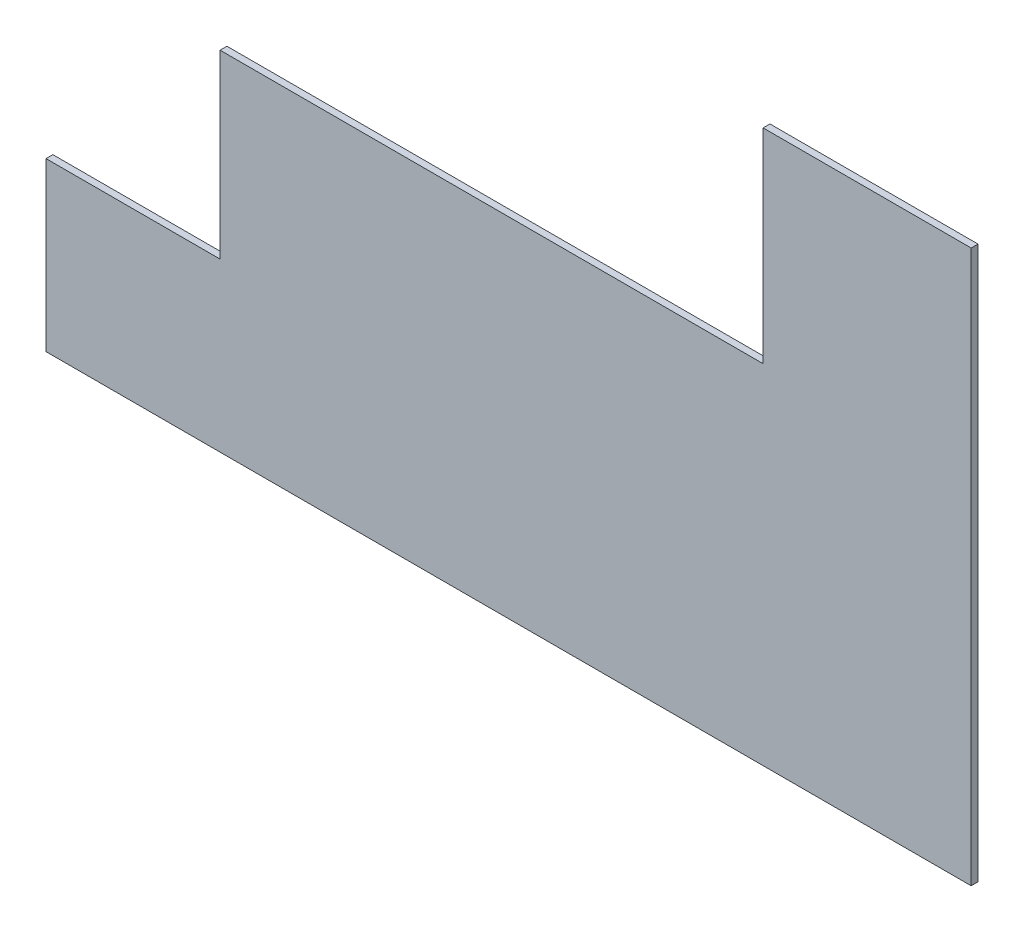
ISO-10303-21;
HEADER;
FILE_DESCRIPTION(('STEP AP214'),'2;1');
FILE_NAME('part.step','',(''),(''),'','','');
FILE_SCHEMA(('AUTOMOTIVE_DESIGN { 1 0 10303 214 1 1 1 1 }'));
ENDSEC;
DATA;
#1=APPLICATION_CONTEXT('core data for automotive mechanical design processes');
#2=APPLICATION_PROTOCOL_DEFINITION('international standard','automotive_design',2000,#1);
#3=PRODUCT_CONTEXT('',#1,'mechanical');
#4=PRODUCT('Part','Part','',(#3));
#5=PRODUCT_RELATED_PRODUCT_CATEGORY('part','',(#4));
#6=PRODUCT_DEFINITION_FORMATION('','',#4);
#7=PRODUCT_DEFINITION_CONTEXT('part definition',#1,'design');
#8=PRODUCT_DEFINITION('design','',#6,#7);
#9=PRODUCT_DEFINITION_SHAPE('','',#8);
#10=(LENGTH_UNIT() NAMED_UNIT(*) SI_UNIT(.MILLI.,.METRE.));
#11=(NAMED_UNIT(*) PLANE_ANGLE_UNIT() SI_UNIT($,.RADIAN.));
#12=(NAMED_UNIT(*) SI_UNIT($,.STERADIAN.) SOLID_ANGLE_UNIT());
#13=UNCERTAINTY_MEASURE_WITH_UNIT(LENGTH_MEASURE(1.E-05),#10,'distance_accuracy_value','');
#14=(GEOMETRIC_REPRESENTATION_CONTEXT(3) GLOBAL_UNCERTAINTY_ASSIGNED_CONTEXT((#13)) GLOBAL_UNIT_ASSIGNED_CONTEXT((#10,
#11,#12)) REPRESENTATION_CONTEXT('',''));
#15=CARTESIAN_POINT('',(0.,0.,0.));
#16=DIRECTION('',(0.,0.,1.));
#17=DIRECTION('',(1.,0.,0.));
#18=AXIS2_PLACEMENT_3D('',#15,#16,#17);
#19=CARTESIAN_POINT('',(0.,0.,-25.));
#20=DIRECTION('',(0.,0.,-1.));
#21=DIRECTION('',(-1.,0.,0.));
#22=AXIS2_PLACEMENT_3D('',#19,#20,#21);
#23=PLANE('',#22);
#24=DIRECTION('',(0.,-1.,0.));
#25=VECTOR('',#24,1.);
#26=CARTESIAN_POINT('',(5400.,0.,-25.));
#27=LINE('',#26,#25);
#28=CARTESIAN_POINT('',(5400.,2020.,-25.));
#29=VERTEX_POINT('',#28);
#30=CARTESIAN_POINT('',(5400.,5.00000000000029,-25.));
#31=VERTEX_POINT('',#30);
#32=EDGE_CURVE('E110',#29,#31,#27,.T.);
#33=ORIENTED_EDGE('',*,*,#32,.T.);
#34=DIRECTION('',(1.,0.,0.));
#35=VECTOR('',#34,1.);
#36=CARTESIAN_POINT('',(0.,4.99999999999962,-25.));
#37=LINE('',#36,#35);
#38=CARTESIAN_POINT('',(2025.,4.99999999999987,-25.));
#39=VERTEX_POINT('',#38);
#40=EDGE_CURVE('E155',#39,#31,#37,.T.);
#41=ORIENTED_EDGE('',*,*,#40,.F.);
#42=DIRECTION('',(0.,-1.,0.));
#43=VECTOR('',#42,1.);
#44=CARTESIAN_POINT('',(2025.,0.,-25.));
#45=LINE('',#44,#43);
#46=CARTESIAN_POINT('',(2025.,615.,-25.));
#47=VERTEX_POINT('',#46);
#48=EDGE_CURVE('E63',#47,#39,#45,.T.);
#49=ORIENTED_EDGE('',*,*,#48,.F.);
#50=DIRECTION('',(-1.,0.,0.));
#51=VECTOR('',#50,1.);
#52=CARTESIAN_POINT('',(0.,615.,-25.));
#53=LINE('',#52,#51);
#54=CARTESIAN_POINT('',(2660.,615.,-25.));
#55=VERTEX_POINT('',#54);
#56=EDGE_CURVE('E166',#55,#47,#53,.T.);
#57=ORIENTED_EDGE('',*,*,#56,.F.);
#58=DIRECTION('',(0.,1.,0.));
#59=VECTOR('',#58,1.);
#60=CARTESIAN_POINT('',(2660.,0.,-25.));
#61=LINE('',#60,#59);
#62=CARTESIAN_POINT('',(2660.,1275.,-25.));
#63=VERTEX_POINT('',#62);
#64=EDGE_CURVE('E163',#55,#63,#61,.T.);
#65=ORIENTED_EDGE('',*,*,#64,.T.);
#66=DIRECTION('',(1.,0.,0.));
#67=VECTOR('',#66,1.);
#68=CARTESIAN_POINT('',(2660.,1275.,-25.));
#69=LINE('',#68,#67);
#70=CARTESIAN_POINT('',(4641.,1275.,-25.));
#71=VERTEX_POINT('',#70);
#72=EDGE_CURVE('E136',#63,#71,#69,.T.);
#73=ORIENTED_EDGE('',*,*,#72,.T.);
#74=DIRECTION('',(0.,1.,0.));
#75=VECTOR('',#74,1.);
#76=CARTESIAN_POINT('',(4641.,1275.,-25.));
#77=LINE('',#76,#75);
#78=CARTESIAN_POINT('',(4641.,2020.,-25.));
#79=VERTEX_POINT('',#78);
#80=EDGE_CURVE('E114',#71,#79,#77,.T.);
#81=ORIENTED_EDGE('',*,*,#80,.T.);
#82=DIRECTION('',(-1.,0.,0.));
#83=VECTOR('',#82,1.);
#84=CARTESIAN_POINT('',(2935.,2020.,-25.));
#85=LINE('',#84,#83);
#86=EDGE_CURVE('E48',#29,#79,#85,.T.);
#87=ORIENTED_EDGE('',*,*,#86,.F.);
#88=EDGE_LOOP('',(#33,#41,#49,#57,#65,#73,#81,#87));
#89=FACE_BOUND('',#88,.T.);
#90=ADVANCED_FACE('F40',(#89),#23,.T.);
#91=CARTESIAN_POINT('',(0.,0.,0.));
#92=DIRECTION('',(0.,0.,-1.));
#93=DIRECTION('',(-1.,0.,0.));
#94=AXIS2_PLACEMENT_3D('',#91,#92,#93);
#95=PLANE('',#94);
#96=DIRECTION('',(1.,0.,0.));
#97=VECTOR('',#96,1.);
#98=CARTESIAN_POINT('',(0.,4.99999999999962,0.));
#99=LINE('',#98,#97);
#100=CARTESIAN_POINT('',(2025.,4.99999999999987,0.));
#101=VERTEX_POINT('',#100);
#102=CARTESIAN_POINT('',(5400.,5.00000000000029,0.));
#103=VERTEX_POINT('',#102);
#104=EDGE_CURVE('E152',#101,#103,#99,.T.);
#105=ORIENTED_EDGE('',*,*,#104,.T.);
#106=DIRECTION('',(0.,1.,0.));
#107=VECTOR('',#106,1.);
#108=CARTESIAN_POINT('',(5400.,0.,0.));
#109=LINE('',#108,#107);
#110=CARTESIAN_POINT('',(5400.,2020.,0.));
#111=VERTEX_POINT('',#110);
#112=EDGE_CURVE('E55',#103,#111,#109,.T.);
#113=ORIENTED_EDGE('',*,*,#112,.T.);
#114=DIRECTION('',(-1.,0.,0.));
#115=VECTOR('',#114,1.);
#116=CARTESIAN_POINT('',(2935.,2020.,0.));
#117=LINE('',#116,#115);
#118=CARTESIAN_POINT('',(4641.,2020.,0.));
#119=VERTEX_POINT('',#118);
#120=EDGE_CURVE('E117',#111,#119,#117,.T.);
#121=ORIENTED_EDGE('',*,*,#120,.T.);
#122=DIRECTION('',(0.,-1.,0.));
#123=VECTOR('',#122,1.);
#124=CARTESIAN_POINT('',(4641.,0.,0.));
#125=LINE('',#124,#123);
#126=CARTESIAN_POINT('',(4641.,1275.,0.));
#127=VERTEX_POINT('',#126);
#128=EDGE_CURVE('E149',#119,#127,#125,.T.);
#129=ORIENTED_EDGE('',*,*,#128,.T.);
#130=DIRECTION('',(-1.,0.,0.));
#131=VECTOR('',#130,1.);
#132=CARTESIAN_POINT('',(0.,1275.,0.));
#133=LINE('',#132,#131);
#134=CARTESIAN_POINT('',(2660.,1275.,0.));
#135=VERTEX_POINT('',#134);
#136=EDGE_CURVE('E142',#127,#135,#133,.T.);
#137=ORIENTED_EDGE('',*,*,#136,.T.);
#138=DIRECTION('',(0.,1.,0.));
#139=VECTOR('',#138,1.);
#140=CARTESIAN_POINT('',(2660.,0.,0.));
#141=LINE('',#140,#139);
#142=CARTESIAN_POINT('',(2660.,615.,0.));
#143=VERTEX_POINT('',#142);
#144=EDGE_CURVE('E160',#143,#135,#141,.T.);
#145=ORIENTED_EDGE('',*,*,#144,.F.);
#146=DIRECTION('',(-1.,0.,0.));
#147=VECTOR('',#146,1.);
#148=CARTESIAN_POINT('',(0.,615.,0.));
#149=LINE('',#148,#147);
#150=CARTESIAN_POINT('',(2025.,615.,0.));
#151=VERTEX_POINT('',#150);
#152=EDGE_CURVE('E11',#143,#151,#149,.T.);
#153=ORIENTED_EDGE('',*,*,#152,.T.);
#154=DIRECTION('',(0.,1.,0.));
#155=VECTOR('',#154,1.);
#156=CARTESIAN_POINT('',(2025.,0.,0.));
#157=LINE('',#156,#155);
#158=EDGE_CURVE('E129',#101,#151,#157,.T.);
#159=ORIENTED_EDGE('',*,*,#158,.F.);
#160=EDGE_LOOP('',(#105,#113,#121,#129,#137,#145,#153,#159));
#161=FACE_BOUND('',#160,.T.);
#162=ADVANCED_FACE('F169',(#161),#95,.F.);
#163=CARTESIAN_POINT('',(0.,615.,-25.000025));
#164=DIRECTION('',(0.,-1.,0.));
#165=DIRECTION('',(0.,0.,-1.));
#166=AXIS2_PLACEMENT_3D('',#163,#164,#165);
#167=PLANE('',#166);
#168=DIRECTION('',(0.,0.,1.));
#169=VECTOR('',#168,1.);
#170=CARTESIAN_POINT('',(2025.,615.,-25.));
#171=LINE('',#170,#169);
#172=EDGE_CURVE('E126',#47,#151,#171,.T.);
#173=ORIENTED_EDGE('',*,*,#172,.T.);
#174=ORIENTED_EDGE('',*,*,#152,.F.);
#175=DIRECTION('',(0.,0.,1.));
#176=VECTOR('',#175,1.);
#177=CARTESIAN_POINT('',(2660.,615.,-25.000025));
#178=LINE('',#177,#176);
#179=EDGE_CURVE('E157',#55,#143,#178,.T.);
#180=ORIENTED_EDGE('',*,*,#179,.F.);
#181=ORIENTED_EDGE('',*,*,#56,.T.);
#182=EDGE_LOOP('',(#173,#174,#180,#181));
#183=FACE_BOUND('',#182,.T.);
#184=ADVANCED_FACE('F177',(#183),#167,.F.);
#185=CARTESIAN_POINT('',(0.,4.99999999999962,-25.000025));
#186=DIRECTION('',(0.,1.,0.));
#187=DIRECTION('',(-1.,0.,0.));
#188=AXIS2_PLACEMENT_3D('',#185,#186,#187);
#189=PLANE('',#188);
#190=ORIENTED_EDGE('',*,*,#40,.T.);
#191=DIRECTION('',(0.,0.,1.));
#192=VECTOR('',#191,1.);
#193=CARTESIAN_POINT('',(5400.,5.00000000000029,-25.));
#194=LINE('',#193,#192);
#195=EDGE_CURVE('E121',#31,#103,#194,.T.);
#196=ORIENTED_EDGE('',*,*,#195,.T.);
#197=ORIENTED_EDGE('',*,*,#104,.F.);
#198=DIRECTION('',(0.,0.,1.));
#199=VECTOR('',#198,1.);
#200=CARTESIAN_POINT('',(2025.,4.99999999999987,-25.));
#201=LINE('',#200,#199);
#202=EDGE_CURVE('E124',#39,#101,#201,.T.);
#203=ORIENTED_EDGE('',*,*,#202,.F.);
#204=EDGE_LOOP('',(#190,#196,#197,#203));
#205=FACE_BOUND('',#204,.T.);
#206=ADVANCED_FACE('F173',(#205),#189,.F.);
#207=CARTESIAN_POINT('',(2935.,2020.,-25.));
#208=DIRECTION('',(0.,1.,0.));
#209=DIRECTION('',(0.,0.,1.));
#210=AXIS2_PLACEMENT_3D('',#207,#208,#209);
#211=PLANE('',#210);
#212=DIRECTION('',(0.,0.,1.));
#213=VECTOR('',#212,1.);
#214=CARTESIAN_POINT('',(4641.,2020.,-25.));
#215=LINE('',#214,#213);
#216=EDGE_CURVE('E140',#79,#119,#215,.T.);
#217=ORIENTED_EDGE('',*,*,#216,.T.);
#218=ORIENTED_EDGE('',*,*,#120,.F.);
#219=DIRECTION('',(0.,0.,1.));
#220=VECTOR('',#219,1.);
#221=CARTESIAN_POINT('',(5400.,2020.,-25.));
#222=LINE('',#221,#220);
#223=EDGE_CURVE('E119',#29,#111,#222,.T.);
#224=ORIENTED_EDGE('',*,*,#223,.F.);
#225=ORIENTED_EDGE('',*,*,#86,.T.);
#226=EDGE_LOOP('',(#217,#218,#224,#225));
#227=FACE_BOUND('',#226,.T.);
#228=ADVANCED_FACE('F42',(#227),#211,.T.);
#229=CARTESIAN_POINT('',(2660.,0.,-25.000025));
#230=DIRECTION('',(-1.,0.,0.));
#231=DIRECTION('',(0.,0.,1.));
#232=AXIS2_PLACEMENT_3D('',#229,#230,#231);
#233=PLANE('',#232);
#234=DIRECTION('',(0.,0.,1.));
#235=VECTOR('',#234,1.);
#236=CARTESIAN_POINT('',(2660.,1275.,-25.));
#237=LINE('',#236,#235);
#238=EDGE_CURVE('E139',#63,#135,#237,.T.);
#239=ORIENTED_EDGE('',*,*,#238,.F.);
#240=ORIENTED_EDGE('',*,*,#64,.F.);
#241=ORIENTED_EDGE('',*,*,#179,.T.);
#242=ORIENTED_EDGE('',*,*,#144,.T.);
#243=EDGE_LOOP('',(#239,#240,#241,#242));
#244=FACE_BOUND('',#243,.T.);
#245=ADVANCED_FACE('F181',(#244),#233,.T.);
#246=CARTESIAN_POINT('',(4641.,1275.,-25.));
#247=DIRECTION('',(1.,0.,0.));
#248=DIRECTION('',(0.,0.,-1.));
#249=AXIS2_PLACEMENT_3D('',#246,#247,#248);
#250=PLANE('',#249);
#251=ORIENTED_EDGE('',*,*,#216,.F.);
#252=ORIENTED_EDGE('',*,*,#80,.F.);
#253=DIRECTION('',(0.,0.,1.));
#254=VECTOR('',#253,1.);
#255=CARTESIAN_POINT('',(4641.,1275.,-25.));
#256=LINE('',#255,#254);
#257=EDGE_CURVE('E143',#71,#127,#256,.T.);
#258=ORIENTED_EDGE('',*,*,#257,.T.);
#259=ORIENTED_EDGE('',*,*,#128,.F.);
#260=EDGE_LOOP('',(#251,#252,#258,#259));
#261=FACE_BOUND('',#260,.T.);
#262=ADVANCED_FACE('F185',(#261),#250,.F.);
#263=CARTESIAN_POINT('',(2660.,1275.,-25.));
#264=DIRECTION('',(0.,-1.,0.));
#265=DIRECTION('',(0.,0.,-1.));
#266=AXIS2_PLACEMENT_3D('',#263,#264,#265);
#267=PLANE('',#266);
#268=ORIENTED_EDGE('',*,*,#257,.F.);
#269=ORIENTED_EDGE('',*,*,#72,.F.);
#270=ORIENTED_EDGE('',*,*,#238,.T.);
#271=ORIENTED_EDGE('',*,*,#136,.F.);
#272=EDGE_LOOP('',(#268,#269,#270,#271));
#273=FACE_BOUND('',#272,.T.);
#274=ADVANCED_FACE('F183',(#273),#267,.F.);
#275=CARTESIAN_POINT('',(2025.,0.,-25.));
#276=DIRECTION('',(-1.,0.,0.));
#277=DIRECTION('',(0.,0.,1.));
#278=AXIS2_PLACEMENT_3D('',#275,#276,#277);
#279=PLANE('',#278);
#280=ORIENTED_EDGE('',*,*,#158,.T.);
#281=ORIENTED_EDGE('',*,*,#172,.F.);
#282=ORIENTED_EDGE('',*,*,#48,.T.);
#283=ORIENTED_EDGE('',*,*,#202,.T.);
#284=EDGE_LOOP('',(#280,#281,#282,#283));
#285=FACE_BOUND('',#284,.T.);
#286=ADVANCED_FACE('F192',(#285),#279,.T.);
#287=CARTESIAN_POINT('',(5400.,0.,-25.));
#288=DIRECTION('',(-1.,0.,0.));
#289=DIRECTION('',(0.,0.,1.));
#290=AXIS2_PLACEMENT_3D('',#287,#288,#289);
#291=PLANE('',#290);
#292=ORIENTED_EDGE('',*,*,#195,.F.);
#293=ORIENTED_EDGE('',*,*,#32,.F.);
#294=ORIENTED_EDGE('',*,*,#223,.T.);
#295=ORIENTED_EDGE('',*,*,#112,.F.);
#296=EDGE_LOOP('',(#292,#293,#294,#295));
#297=FACE_BOUND('',#296,.T.);
#298=ADVANCED_FACE('F123',(#297),#291,.F.);
#299=CLOSED_SHELL('',(#90,#162,#184,#206,#228,#245,#262,#274,#286,#298));
#300=MANIFOLD_SOLID_BREP('B2',#299);
#301=ADVANCED_BREP_SHAPE_REPRESENTATION('',(#18,#300),#14);
#302=SHAPE_DEFINITION_REPRESENTATION(#9,#301);
ENDSEC;
END-ISO-10303-21;
